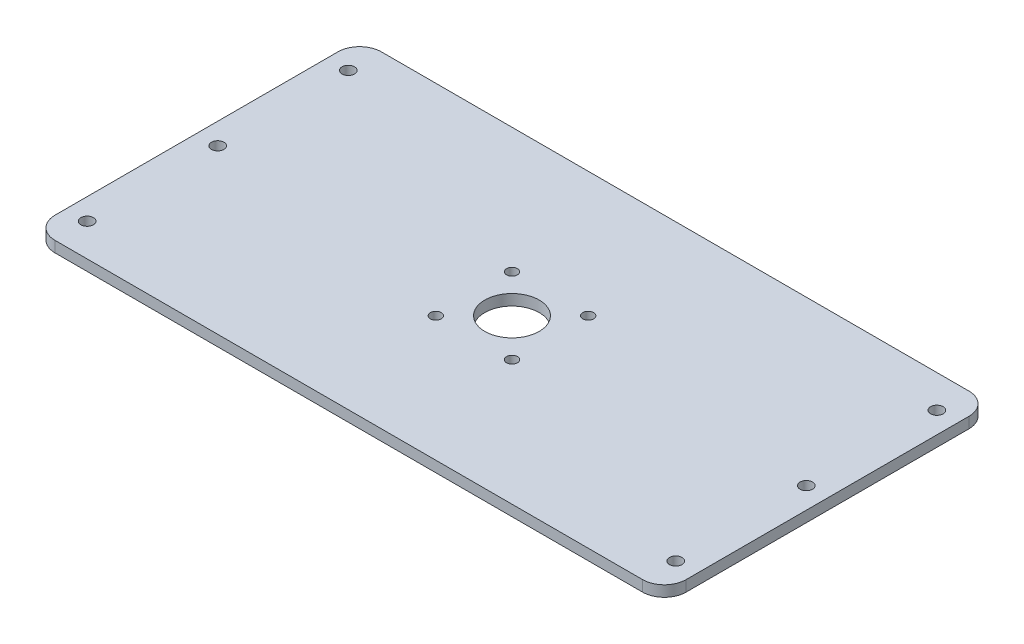
ISO-10303-21;
HEADER;
FILE_DESCRIPTION(('STEP AP214'),'2;1');
FILE_NAME('part.step','',(''),(''),'','','');
FILE_SCHEMA(('AUTOMOTIVE_DESIGN { 1 0 10303 214 1 1 1 1 }'));
ENDSEC;
DATA;
#1=APPLICATION_CONTEXT('core data for automotive mechanical design processes');
#2=APPLICATION_PROTOCOL_DEFINITION('international standard','automotive_design',2000,#1);
#3=PRODUCT_CONTEXT('',#1,'mechanical');
#4=PRODUCT('Part','Part','',(#3));
#5=PRODUCT_RELATED_PRODUCT_CATEGORY('part','',(#4));
#6=PRODUCT_DEFINITION_FORMATION('','',#4);
#7=PRODUCT_DEFINITION_CONTEXT('part definition',#1,'design');
#8=PRODUCT_DEFINITION('design','',#6,#7);
#9=PRODUCT_DEFINITION_SHAPE('','',#8);
#10=(LENGTH_UNIT() NAMED_UNIT(*) SI_UNIT(.MILLI.,.METRE.));
#11=(NAMED_UNIT(*) PLANE_ANGLE_UNIT() SI_UNIT($,.RADIAN.));
#12=(NAMED_UNIT(*) SI_UNIT($,.STERADIAN.) SOLID_ANGLE_UNIT());
#13=UNCERTAINTY_MEASURE_WITH_UNIT(LENGTH_MEASURE(1.E-05),#10,'distance_accuracy_value','');
#14=(GEOMETRIC_REPRESENTATION_CONTEXT(3) GLOBAL_UNCERTAINTY_ASSIGNED_CONTEXT((#13)) GLOBAL_UNIT_ASSIGNED_CONTEXT((#10,
#11,#12)) REPRESENTATION_CONTEXT('',''));
#15=CARTESIAN_POINT('',(0.,0.,0.));
#16=DIRECTION('',(0.,0.,1.));
#17=DIRECTION('',(1.,0.,0.));
#18=AXIS2_PLACEMENT_3D('',#15,#16,#17);
#19=CARTESIAN_POINT('',(-145.,5.,0.));
#20=DIRECTION('',(-1.,0.,0.));
#21=DIRECTION('',(0.,0.,1.));
#22=AXIS2_PLACEMENT_3D('',#19,#20,#21);
#23=PLANE('',#22);
#24=DIRECTION('',(0.,0.,-1.));
#25=VECTOR('',#24,1.);
#26=CARTESIAN_POINT('',(-145.,5.,0.));
#27=LINE('',#26,#25);
#28=CARTESIAN_POINT('',(-145.,5.,65.));
#29=VERTEX_POINT('',#28);
#30=CARTESIAN_POINT('',(-145.,5.,-65.));
#31=VERTEX_POINT('',#30);
#32=EDGE_CURVE('E187',#29,#31,#27,.T.);
#33=ORIENTED_EDGE('',*,*,#32,.T.);
#34=DIRECTION('',(0.,-1.,0.));
#35=VECTOR('',#34,1.);
#36=CARTESIAN_POINT('',(-145.,0.,-65.));
#37=LINE('',#36,#35);
#38=CARTESIAN_POINT('',(-145.,0.,-65.));
#39=VERTEX_POINT('',#38);
#40=EDGE_CURVE('E123',#31,#39,#37,.T.);
#41=ORIENTED_EDGE('',*,*,#40,.T.);
#42=DIRECTION('',(0.,0.,-1.));
#43=VECTOR('',#42,1.);
#44=CARTESIAN_POINT('',(-145.,0.,0.));
#45=LINE('',#44,#43);
#46=CARTESIAN_POINT('',(-145.,0.,65.));
#47=VERTEX_POINT('',#46);
#48=EDGE_CURVE('E114',#47,#39,#45,.T.);
#49=ORIENTED_EDGE('',*,*,#48,.F.);
#50=DIRECTION('',(0.,-1.,0.));
#51=VECTOR('',#50,1.);
#52=CARTESIAN_POINT('',(-145.,5.,65.));
#53=LINE('',#52,#51);
#54=EDGE_CURVE('E128',#47,#29,#53,.F.);
#55=ORIENTED_EDGE('',*,*,#54,.T.);
#56=EDGE_LOOP('',(#33,#41,#49,#55));
#57=FACE_BOUND('',#56,.T.);
#58=ADVANCED_FACE('F43',(#57),#23,.T.);
#59=CARTESIAN_POINT('',(0.,5.,75.));
#60=DIRECTION('',(0.,0.,1.));
#61=DIRECTION('',(1.,0.,0.));
#62=AXIS2_PLACEMENT_3D('',#59,#60,#61);
#63=PLANE('',#62);
#64=DIRECTION('',(-1.,0.,0.));
#65=VECTOR('',#64,1.);
#66=CARTESIAN_POINT('',(0.,0.,75.));
#67=LINE('',#66,#65);
#68=CARTESIAN_POINT('',(135.,0.,75.));
#69=VERTEX_POINT('',#68);
#70=CARTESIAN_POINT('',(-135.,0.,75.));
#71=VERTEX_POINT('',#70);
#72=EDGE_CURVE('E116',#69,#71,#67,.T.);
#73=ORIENTED_EDGE('',*,*,#72,.F.);
#74=DIRECTION('',(0.,-1.,0.));
#75=VECTOR('',#74,1.);
#76=CARTESIAN_POINT('',(135.,5.,75.));
#77=LINE('',#76,#75);
#78=CARTESIAN_POINT('',(135.,5.,75.));
#79=VERTEX_POINT('',#78);
#80=EDGE_CURVE('E11',#69,#79,#77,.F.);
#81=ORIENTED_EDGE('',*,*,#80,.T.);
#82=DIRECTION('',(-1.,0.,0.));
#83=VECTOR('',#82,1.);
#84=CARTESIAN_POINT('',(0.,5.,75.));
#85=LINE('',#84,#83);
#86=CARTESIAN_POINT('',(-135.,5.,75.));
#87=VERTEX_POINT('',#86);
#88=EDGE_CURVE('E184',#79,#87,#85,.T.);
#89=ORIENTED_EDGE('',*,*,#88,.T.);
#90=DIRECTION('',(0.,-1.,0.));
#91=VECTOR('',#90,1.);
#92=CARTESIAN_POINT('',(-135.,5.,75.));
#93=LINE('',#92,#91);
#94=EDGE_CURVE('E52',#87,#71,#93,.T.);
#95=ORIENTED_EDGE('',*,*,#94,.T.);
#96=EDGE_LOOP('',(#73,#81,#89,#95));
#97=FACE_BOUND('',#96,.T.);
#98=ADVANCED_FACE('F182',(#97),#63,.T.);
#99=CARTESIAN_POINT('',(145.,5.,0.));
#100=DIRECTION('',(-1.,0.,0.));
#101=DIRECTION('',(0.,0.,1.));
#102=AXIS2_PLACEMENT_3D('',#99,#100,#101);
#103=PLANE('',#102);
#104=DIRECTION('',(0.,0.,-1.));
#105=VECTOR('',#104,1.);
#106=CARTESIAN_POINT('',(145.,0.,0.));
#107=LINE('',#106,#105);
#108=CARTESIAN_POINT('',(145.,0.,65.));
#109=VERTEX_POINT('',#108);
#110=CARTESIAN_POINT('',(145.,0.,-65.));
#111=VERTEX_POINT('',#110);
#112=EDGE_CURVE('E240',#109,#111,#107,.T.);
#113=ORIENTED_EDGE('',*,*,#112,.T.);
#114=DIRECTION('',(0.,-1.,0.));
#115=VECTOR('',#114,1.);
#116=CARTESIAN_POINT('',(145.,5.,-65.));
#117=LINE('',#116,#115);
#118=CARTESIAN_POINT('',(145.,5.,-65.));
#119=VERTEX_POINT('',#118);
#120=EDGE_CURVE('E59',#111,#119,#117,.F.);
#121=ORIENTED_EDGE('',*,*,#120,.T.);
#122=DIRECTION('',(0.,0.,-1.));
#123=VECTOR('',#122,1.);
#124=CARTESIAN_POINT('',(145.,5.,0.));
#125=LINE('',#124,#123);
#126=CARTESIAN_POINT('',(145.,5.,65.));
#127=VERTEX_POINT('',#126);
#128=EDGE_CURVE('E186',#127,#119,#125,.T.);
#129=ORIENTED_EDGE('',*,*,#128,.F.);
#130=DIRECTION('',(0.,-1.,0.));
#131=VECTOR('',#130,1.);
#132=CARTESIAN_POINT('',(145.,0.,65.));
#133=LINE('',#132,#131);
#134=EDGE_CURVE('E174',#127,#109,#133,.T.);
#135=ORIENTED_EDGE('',*,*,#134,.T.);
#136=EDGE_LOOP('',(#113,#121,#129,#135));
#137=FACE_BOUND('',#136,.T.);
#138=ADVANCED_FACE('F322',(#137),#103,.F.);
#139=CARTESIAN_POINT('',(0.,5.,-75.));
#140=DIRECTION('',(0.,0.,1.));
#141=DIRECTION('',(1.,0.,0.));
#142=AXIS2_PLACEMENT_3D('',#139,#140,#141);
#143=PLANE('',#142);
#144=DIRECTION('',(-1.,0.,0.));
#145=VECTOR('',#144,1.);
#146=CARTESIAN_POINT('',(0.,0.,-75.));
#147=LINE('',#146,#145);
#148=CARTESIAN_POINT('',(135.,0.,-75.));
#149=VERTEX_POINT('',#148);
#150=CARTESIAN_POINT('',(-135.,0.,-75.));
#151=VERTEX_POINT('',#150);
#152=EDGE_CURVE('E242',#149,#151,#147,.T.);
#153=ORIENTED_EDGE('',*,*,#152,.T.);
#154=DIRECTION('',(0.,-1.,0.));
#155=VECTOR('',#154,1.);
#156=CARTESIAN_POINT('',(-135.,5.,-75.));
#157=LINE('',#156,#155);
#158=CARTESIAN_POINT('',(-135.,5.,-75.));
#159=VERTEX_POINT('',#158);
#160=EDGE_CURVE('E161',#151,#159,#157,.F.);
#161=ORIENTED_EDGE('',*,*,#160,.T.);
#162=DIRECTION('',(-1.,0.,0.));
#163=VECTOR('',#162,1.);
#164=CARTESIAN_POINT('',(0.,5.,-75.));
#165=LINE('',#164,#163);
#166=CARTESIAN_POINT('',(135.,5.,-75.));
#167=VERTEX_POINT('',#166);
#168=EDGE_CURVE('E143',#167,#159,#165,.T.);
#169=ORIENTED_EDGE('',*,*,#168,.F.);
#170=DIRECTION('',(0.,-1.,0.));
#171=VECTOR('',#170,1.);
#172=CARTESIAN_POINT('',(135.,5.,-75.));
#173=LINE('',#172,#171);
#174=EDGE_CURVE('E157',#167,#149,#173,.T.);
#175=ORIENTED_EDGE('',*,*,#174,.T.);
#176=EDGE_LOOP('',(#153,#161,#169,#175));
#177=FACE_BOUND('',#176,.T.);
#178=ADVANCED_FACE('F329',(#177),#143,.F.);
#179=CARTESIAN_POINT('',(135.225,5.,0.));
#180=DIRECTION('',(0.,-1.,0.));
#181=DIRECTION('',(0.,0.,-1.));
#182=AXIS2_PLACEMENT_3D('',#179,#180,#181);
#183=CYLINDRICAL_SURFACE('',#182,2.87499999999999);
#184=CARTESIAN_POINT('',(135.225,5.,0.));
#185=DIRECTION('',(0.,1.,0.));
#186=DIRECTION('',(0.,0.,1.));
#187=AXIS2_PLACEMENT_3D('',#184,#185,#186);
#188=CIRCLE('',#187,2.87499999999999);
#189=CARTESIAN_POINT('',(135.225,5.,2.875));
#190=VERTEX_POINT('',#189);
#191=EDGE_CURVE('E192',#190,#190,#188,.T.);
#192=ORIENTED_EDGE('',*,*,#191,.T.);
#193=EDGE_LOOP('',(#192));
#194=FACE_BOUND('',#193,.T.);
#195=CARTESIAN_POINT('',(135.225,0.,0.));
#196=DIRECTION('',(0.,1.,0.));
#197=DIRECTION('',(0.,0.,1.));
#198=AXIS2_PLACEMENT_3D('',#195,#196,#197);
#199=CIRCLE('',#198,2.87499999999999);
#200=CARTESIAN_POINT('',(135.225,0.,2.875));
#201=VERTEX_POINT('',#200);
#202=EDGE_CURVE('E132',#201,#201,#199,.T.);
#203=ORIENTED_EDGE('',*,*,#202,.F.);
#204=EDGE_LOOP('',(#203));
#205=FACE_BOUND('',#204,.T.);
#206=ADVANCED_FACE('F294',(#194,#205),#183,.F.);
#207=CARTESIAN_POINT('',(135.225,5.,-60.));
#208=DIRECTION('',(0.,-1.,0.));
#209=DIRECTION('',(0.,0.,-1.));
#210=AXIS2_PLACEMENT_3D('',#207,#208,#209);
#211=CYLINDRICAL_SURFACE('',#210,2.87499999999999);
#212=CARTESIAN_POINT('',(135.225,5.,-60.));
#213=DIRECTION('',(0.,1.,0.));
#214=DIRECTION('',(0.,0.,1.));
#215=AXIS2_PLACEMENT_3D('',#212,#213,#214);
#216=CIRCLE('',#215,2.87499999999999);
#217=CARTESIAN_POINT('',(135.225,5.,-57.125));
#218=VERTEX_POINT('',#217);
#219=EDGE_CURVE('E287',#218,#218,#216,.T.);
#220=ORIENTED_EDGE('',*,*,#219,.T.);
#221=EDGE_LOOP('',(#220));
#222=FACE_BOUND('',#221,.T.);
#223=CARTESIAN_POINT('',(135.225,0.,-60.));
#224=DIRECTION('',(0.,1.,0.));
#225=DIRECTION('',(0.,0.,1.));
#226=AXIS2_PLACEMENT_3D('',#223,#224,#225);
#227=CIRCLE('',#226,2.87499999999999);
#228=CARTESIAN_POINT('',(135.225,0.,-57.125));
#229=VERTEX_POINT('',#228);
#230=EDGE_CURVE('E231',#229,#229,#227,.T.);
#231=ORIENTED_EDGE('',*,*,#230,.F.);
#232=EDGE_LOOP('',(#231));
#233=FACE_BOUND('',#232,.T.);
#234=ADVANCED_FACE('F328',(#222,#233),#211,.F.);
#235=CARTESIAN_POINT('',(-135.225,5.,-60.));
#236=DIRECTION('',(0.,-1.,0.));
#237=DIRECTION('',(0.,0.,-1.));
#238=AXIS2_PLACEMENT_3D('',#235,#236,#237);
#239=CYLINDRICAL_SURFACE('',#238,2.87499999999999);
#240=CARTESIAN_POINT('',(-135.225,5.,-60.));
#241=DIRECTION('',(0.,1.,0.));
#242=DIRECTION('',(0.,0.,1.));
#243=AXIS2_PLACEMENT_3D('',#240,#241,#242);
#244=CIRCLE('',#243,2.87499999999999);
#245=CARTESIAN_POINT('',(-135.225,5.,-57.125));
#246=VERTEX_POINT('',#245);
#247=EDGE_CURVE('E283',#246,#246,#244,.T.);
#248=ORIENTED_EDGE('',*,*,#247,.T.);
#249=EDGE_LOOP('',(#248));
#250=FACE_BOUND('',#249,.T.);
#251=CARTESIAN_POINT('',(-135.225,0.,-60.));
#252=DIRECTION('',(0.,1.,0.));
#253=DIRECTION('',(0.,0.,1.));
#254=AXIS2_PLACEMENT_3D('',#251,#252,#253);
#255=CIRCLE('',#254,2.87499999999999);
#256=CARTESIAN_POINT('',(-135.225,0.,-57.125));
#257=VERTEX_POINT('',#256);
#258=EDGE_CURVE('E227',#257,#257,#255,.T.);
#259=ORIENTED_EDGE('',*,*,#258,.F.);
#260=EDGE_LOOP('',(#259));
#261=FACE_BOUND('',#260,.T.);
#262=ADVANCED_FACE('F332',(#250,#261),#239,.F.);
#263=CARTESIAN_POINT('',(-135.225,5.,60.));
#264=DIRECTION('',(0.,-1.,0.));
#265=DIRECTION('',(0.,0.,-1.));
#266=AXIS2_PLACEMENT_3D('',#263,#264,#265);
#267=CYLINDRICAL_SURFACE('',#266,2.87499999999999);
#268=CARTESIAN_POINT('',(-135.225,5.,60.));
#269=DIRECTION('',(0.,1.,0.));
#270=DIRECTION('',(0.,0.,1.));
#271=AXIS2_PLACEMENT_3D('',#268,#269,#270);
#272=CIRCLE('',#271,2.87499999999999);
#273=CARTESIAN_POINT('',(-135.225,5.,62.875));
#274=VERTEX_POINT('',#273);
#275=EDGE_CURVE('E279',#274,#274,#272,.F.);
#276=ORIENTED_EDGE('',*,*,#275,.F.);
#277=EDGE_LOOP('',(#276));
#278=FACE_BOUND('',#277,.T.);
#279=CARTESIAN_POINT('',(-135.225,0.,60.));
#280=DIRECTION('',(0.,1.,0.));
#281=DIRECTION('',(0.,0.,1.));
#282=AXIS2_PLACEMENT_3D('',#279,#280,#281);
#283=CIRCLE('',#282,2.87499999999999);
#284=CARTESIAN_POINT('',(-135.225,0.,62.875));
#285=VERTEX_POINT('',#284);
#286=EDGE_CURVE('E223',#285,#285,#283,.F.);
#287=ORIENTED_EDGE('',*,*,#286,.T.);
#288=EDGE_LOOP('',(#287));
#289=FACE_BOUND('',#288,.T.);
#290=ADVANCED_FACE('F336',(#278,#289),#267,.F.);
#291=CARTESIAN_POINT('',(0.,5.,0.));
#292=DIRECTION('',(0.,-1.,0.));
#293=DIRECTION('',(0.,0.,-1.));
#294=AXIS2_PLACEMENT_3D('',#291,#292,#293);
#295=CYLINDRICAL_SURFACE('',#294,12.5);
#296=CARTESIAN_POINT('',(0.,5.,0.));
#297=DIRECTION('',(0.,1.,0.));
#298=DIRECTION('',(0.,0.,1.));
#299=AXIS2_PLACEMENT_3D('',#296,#297,#298);
#300=CIRCLE('',#299,12.5);
#301=CARTESIAN_POINT('',(0.,5.,12.5));
#302=VERTEX_POINT('',#301);
#303=EDGE_CURVE('E275',#302,#302,#300,.T.);
#304=ORIENTED_EDGE('',*,*,#303,.T.);
#305=EDGE_LOOP('',(#304));
#306=FACE_BOUND('',#305,.T.);
#307=CARTESIAN_POINT('',(0.,0.,0.));
#308=DIRECTION('',(0.,1.,0.));
#309=DIRECTION('',(0.,0.,1.));
#310=AXIS2_PLACEMENT_3D('',#307,#308,#309);
#311=CIRCLE('',#310,12.5);
#312=CARTESIAN_POINT('',(0.,0.,12.5));
#313=VERTEX_POINT('',#312);
#314=EDGE_CURVE('E219',#313,#313,#311,.T.);
#315=ORIENTED_EDGE('',*,*,#314,.F.);
#316=EDGE_LOOP('',(#315));
#317=FACE_BOUND('',#316,.T.);
#318=ADVANCED_FACE('F340',(#306,#317),#295,.F.);
#319=CARTESIAN_POINT('',(-17.5,5.,-17.5));
#320=DIRECTION('',(0.,-1.,0.));
#321=DIRECTION('',(0.,0.,-1.));
#322=AXIS2_PLACEMENT_3D('',#319,#320,#321);
#323=CYLINDRICAL_SURFACE('',#322,2.5);
#324=CARTESIAN_POINT('',(-17.5,5.,-17.5));
#325=DIRECTION('',(0.,1.,0.));
#326=DIRECTION('',(0.,0.,1.));
#327=AXIS2_PLACEMENT_3D('',#324,#325,#326);
#328=CIRCLE('',#327,2.5);
#329=CARTESIAN_POINT('',(-17.5,5.,-15.));
#330=VERTEX_POINT('',#329);
#331=EDGE_CURVE('E271',#330,#330,#328,.T.);
#332=ORIENTED_EDGE('',*,*,#331,.T.);
#333=EDGE_LOOP('',(#332));
#334=FACE_BOUND('',#333,.T.);
#335=CARTESIAN_POINT('',(-17.5,0.,-17.5));
#336=DIRECTION('',(0.,1.,0.));
#337=DIRECTION('',(0.,0.,1.));
#338=AXIS2_PLACEMENT_3D('',#335,#336,#337);
#339=CIRCLE('',#338,2.5);
#340=CARTESIAN_POINT('',(-17.5,0.,-15.));
#341=VERTEX_POINT('',#340);
#342=EDGE_CURVE('E215',#341,#341,#339,.T.);
#343=ORIENTED_EDGE('',*,*,#342,.F.);
#344=EDGE_LOOP('',(#343));
#345=FACE_BOUND('',#344,.T.);
#346=ADVANCED_FACE('F344',(#334,#345),#323,.F.);
#347=CARTESIAN_POINT('',(17.5,5.,-17.5));
#348=DIRECTION('',(0.,-1.,0.));
#349=DIRECTION('',(0.,0.,-1.));
#350=AXIS2_PLACEMENT_3D('',#347,#348,#349);
#351=CYLINDRICAL_SURFACE('',#350,2.5);
#352=CARTESIAN_POINT('',(17.5,5.,-17.5));
#353=DIRECTION('',(0.,1.,0.));
#354=DIRECTION('',(0.,0.,1.));
#355=AXIS2_PLACEMENT_3D('',#352,#353,#354);
#356=CIRCLE('',#355,2.5);
#357=CARTESIAN_POINT('',(17.5,5.,-15.));
#358=VERTEX_POINT('',#357);
#359=EDGE_CURVE('E267',#358,#358,#356,.T.);
#360=ORIENTED_EDGE('',*,*,#359,.T.);
#361=EDGE_LOOP('',(#360));
#362=FACE_BOUND('',#361,.T.);
#363=CARTESIAN_POINT('',(17.5,0.,-17.5));
#364=DIRECTION('',(0.,1.,0.));
#365=DIRECTION('',(0.,0.,1.));
#366=AXIS2_PLACEMENT_3D('',#363,#364,#365);
#367=CIRCLE('',#366,2.5);
#368=CARTESIAN_POINT('',(17.5,0.,-15.));
#369=VERTEX_POINT('',#368);
#370=EDGE_CURVE('E211',#369,#369,#367,.T.);
#371=ORIENTED_EDGE('',*,*,#370,.F.);
#372=EDGE_LOOP('',(#371));
#373=FACE_BOUND('',#372,.T.);
#374=ADVANCED_FACE('F348',(#362,#373),#351,.F.);
#375=CARTESIAN_POINT('',(17.5000000000004,5.,17.5));
#376=DIRECTION('',(0.,-1.,0.));
#377=DIRECTION('',(0.,0.,-1.));
#378=AXIS2_PLACEMENT_3D('',#375,#376,#377);
#379=CYLINDRICAL_SURFACE('',#378,2.5);
#380=CARTESIAN_POINT('',(17.5000000000004,5.,17.5));
#381=DIRECTION('',(0.,1.,0.));
#382=DIRECTION('',(0.,0.,1.));
#383=AXIS2_PLACEMENT_3D('',#380,#381,#382);
#384=CIRCLE('',#383,2.5);
#385=CARTESIAN_POINT('',(17.5000000000004,5.,20.));
#386=VERTEX_POINT('',#385);
#387=EDGE_CURVE('E261',#386,#386,#384,.T.);
#388=ORIENTED_EDGE('',*,*,#387,.T.);
#389=EDGE_LOOP('',(#388));
#390=FACE_BOUND('',#389,.T.);
#391=CARTESIAN_POINT('',(17.5000000000004,0.,17.5));
#392=DIRECTION('',(0.,1.,0.));
#393=DIRECTION('',(0.,0.,1.));
#394=AXIS2_PLACEMENT_3D('',#391,#392,#393);
#395=CIRCLE('',#394,2.5);
#396=CARTESIAN_POINT('',(17.5000000000004,0.,20.));
#397=VERTEX_POINT('',#396);
#398=EDGE_CURVE('E207',#397,#397,#395,.T.);
#399=ORIENTED_EDGE('',*,*,#398,.F.);
#400=EDGE_LOOP('',(#399));
#401=FACE_BOUND('',#400,.T.);
#402=ADVANCED_FACE('F352',(#390,#401),#379,.F.);
#403=CARTESIAN_POINT('',(-17.4999999999996,5.,17.5));
#404=DIRECTION('',(0.,-1.,0.));
#405=DIRECTION('',(0.,0.,-1.));
#406=AXIS2_PLACEMENT_3D('',#403,#404,#405);
#407=CYLINDRICAL_SURFACE('',#406,2.5);
#408=CARTESIAN_POINT('',(-17.4999999999996,5.,17.5));
#409=DIRECTION('',(0.,1.,0.));
#410=DIRECTION('',(0.,0.,1.));
#411=AXIS2_PLACEMENT_3D('',#408,#409,#410);
#412=CIRCLE('',#411,2.5);
#413=CARTESIAN_POINT('',(-17.4999999999996,5.,20.));
#414=VERTEX_POINT('',#413);
#415=EDGE_CURVE('E255',#414,#414,#412,.T.);
#416=ORIENTED_EDGE('',*,*,#415,.T.);
#417=EDGE_LOOP('',(#416));
#418=FACE_BOUND('',#417,.T.);
#419=CARTESIAN_POINT('',(-17.4999999999996,0.,17.5));
#420=DIRECTION('',(0.,1.,0.));
#421=DIRECTION('',(0.,0.,1.));
#422=AXIS2_PLACEMENT_3D('',#419,#420,#421);
#423=CIRCLE('',#422,2.5);
#424=CARTESIAN_POINT('',(-17.4999999999996,0.,20.));
#425=VERTEX_POINT('',#424);
#426=EDGE_CURVE('E203',#425,#425,#423,.T.);
#427=ORIENTED_EDGE('',*,*,#426,.F.);
#428=EDGE_LOOP('',(#427));
#429=FACE_BOUND('',#428,.T.);
#430=ADVANCED_FACE('F313',(#418,#429),#407,.F.);
#431=CARTESIAN_POINT('',(-135.225,5.,0.));
#432=DIRECTION('',(0.,-1.,0.));
#433=DIRECTION('',(0.,0.,-1.));
#434=AXIS2_PLACEMENT_3D('',#431,#432,#433);
#435=CYLINDRICAL_SURFACE('',#434,2.87499999999999);
#436=CARTESIAN_POINT('',(-135.225,5.,0.));
#437=DIRECTION('',(0.,1.,0.));
#438=DIRECTION('',(0.,0.,1.));
#439=AXIS2_PLACEMENT_3D('',#436,#437,#438);
#440=CIRCLE('',#439,2.87499999999999);
#441=CARTESIAN_POINT('',(-135.225,5.,2.875));
#442=VERTEX_POINT('',#441);
#443=EDGE_CURVE('E250',#442,#442,#440,.T.);
#444=ORIENTED_EDGE('',*,*,#443,.T.);
#445=EDGE_LOOP('',(#444));
#446=FACE_BOUND('',#445,.T.);
#447=CARTESIAN_POINT('',(-135.225,0.,0.));
#448=DIRECTION('',(0.,1.,0.));
#449=DIRECTION('',(0.,0.,1.));
#450=AXIS2_PLACEMENT_3D('',#447,#448,#449);
#451=CIRCLE('',#450,2.87499999999999);
#452=CARTESIAN_POINT('',(-135.225,0.,2.875));
#453=VERTEX_POINT('',#452);
#454=EDGE_CURVE('E199',#453,#453,#451,.T.);
#455=ORIENTED_EDGE('',*,*,#454,.F.);
#456=EDGE_LOOP('',(#455));
#457=FACE_BOUND('',#456,.T.);
#458=ADVANCED_FACE('F308',(#446,#457),#435,.F.);
#459=CARTESIAN_POINT('',(135.225,5.,60.));
#460=DIRECTION('',(0.,-1.,0.));
#461=DIRECTION('',(0.,0.,-1.));
#462=AXIS2_PLACEMENT_3D('',#459,#460,#461);
#463=CYLINDRICAL_SURFACE('',#462,2.87499999999999);
#464=CARTESIAN_POINT('',(135.225,5.,60.));
#465=DIRECTION('',(0.,1.,0.));
#466=DIRECTION('',(0.,0.,1.));
#467=AXIS2_PLACEMENT_3D('',#464,#465,#466);
#468=CIRCLE('',#467,2.87499999999999);
#469=CARTESIAN_POINT('',(135.225,5.,62.8749999999999));
#470=VERTEX_POINT('',#469);
#471=EDGE_CURVE('E137',#470,#470,#468,.F.);
#472=ORIENTED_EDGE('',*,*,#471,.F.);
#473=EDGE_LOOP('',(#472));
#474=FACE_BOUND('',#473,.T.);
#475=CARTESIAN_POINT('',(135.225,0.,60.));
#476=DIRECTION('',(0.,1.,0.));
#477=DIRECTION('',(0.,0.,1.));
#478=AXIS2_PLACEMENT_3D('',#475,#476,#477);
#479=CIRCLE('',#478,2.87499999999999);
#480=CARTESIAN_POINT('',(135.225,0.,62.8749999999999));
#481=VERTEX_POINT('',#480);
#482=EDGE_CURVE('E146',#481,#481,#479,.F.);
#483=ORIENTED_EDGE('',*,*,#482,.T.);
#484=EDGE_LOOP('',(#483));
#485=FACE_BOUND('',#484,.T.);
#486=ADVANCED_FACE('F299',(#474,#485),#463,.F.);
#487=CARTESIAN_POINT('',(0.,5.,0.));
#488=DIRECTION('',(0.,1.,0.));
#489=DIRECTION('',(0.,0.,1.));
#490=AXIS2_PLACEMENT_3D('',#487,#488,#489);
#491=PLANE('',#490);
#492=ORIENTED_EDGE('',*,*,#443,.F.);
#493=EDGE_LOOP('',(#492));
#494=FACE_BOUND('',#493,.T.);
#495=ORIENTED_EDGE('',*,*,#415,.F.);
#496=EDGE_LOOP('',(#495));
#497=FACE_BOUND('',#496,.T.);
#498=ORIENTED_EDGE('',*,*,#387,.F.);
#499=EDGE_LOOP('',(#498));
#500=FACE_BOUND('',#499,.T.);
#501=ORIENTED_EDGE('',*,*,#359,.F.);
#502=EDGE_LOOP('',(#501));
#503=FACE_BOUND('',#502,.T.);
#504=ORIENTED_EDGE('',*,*,#331,.F.);
#505=EDGE_LOOP('',(#504));
#506=FACE_BOUND('',#505,.T.);
#507=ORIENTED_EDGE('',*,*,#303,.F.);
#508=EDGE_LOOP('',(#507));
#509=FACE_BOUND('',#508,.T.);
#510=ORIENTED_EDGE('',*,*,#275,.T.);
#511=EDGE_LOOP('',(#510));
#512=FACE_BOUND('',#511,.T.);
#513=ORIENTED_EDGE('',*,*,#247,.F.);
#514=EDGE_LOOP('',(#513));
#515=FACE_BOUND('',#514,.T.);
#516=ORIENTED_EDGE('',*,*,#219,.F.);
#517=EDGE_LOOP('',(#516));
#518=FACE_BOUND('',#517,.T.);
#519=ORIENTED_EDGE('',*,*,#191,.F.);
#520=EDGE_LOOP('',(#519));
#521=FACE_BOUND('',#520,.T.);
#522=ORIENTED_EDGE('',*,*,#168,.T.);
#523=CARTESIAN_POINT('',(-135.,5.,-65.));
#524=DIRECTION('',(0.,1.,0.));
#525=DIRECTION('',(0.,0.,1.));
#526=AXIS2_PLACEMENT_3D('',#523,#524,#525);
#527=CIRCLE('',#526,10.);
#528=EDGE_CURVE('E171',#159,#31,#527,.T.);
#529=ORIENTED_EDGE('',*,*,#528,.T.);
#530=ORIENTED_EDGE('',*,*,#32,.F.);
#531=CARTESIAN_POINT('',(-135.,5.,65.));
#532=DIRECTION('',(0.,1.,0.));
#533=DIRECTION('',(0.,0.,1.));
#534=AXIS2_PLACEMENT_3D('',#531,#532,#533);
#535=CIRCLE('',#534,10.);
#536=EDGE_CURVE('E135',#29,#87,#535,.T.);
#537=ORIENTED_EDGE('',*,*,#536,.T.);
#538=ORIENTED_EDGE('',*,*,#88,.F.);
#539=CARTESIAN_POINT('',(135.,5.,65.));
#540=DIRECTION('',(0.,1.,0.));
#541=DIRECTION('',(0.,0.,1.));
#542=AXIS2_PLACEMENT_3D('',#539,#540,#541);
#543=CIRCLE('',#542,10.);
#544=EDGE_CURVE('E66',#79,#127,#543,.T.);
#545=ORIENTED_EDGE('',*,*,#544,.T.);
#546=ORIENTED_EDGE('',*,*,#128,.T.);
#547=CARTESIAN_POINT('',(135.,5.,-65.));
#548=DIRECTION('',(0.,1.,0.));
#549=DIRECTION('',(0.,0.,1.));
#550=AXIS2_PLACEMENT_3D('',#547,#548,#549);
#551=CIRCLE('',#550,10.);
#552=EDGE_CURVE('E168',#119,#167,#551,.T.);
#553=ORIENTED_EDGE('',*,*,#552,.T.);
#554=EDGE_LOOP('',(#522,#529,#530,#537,#538,#545,#546,#553));
#555=FACE_BOUND('',#554,.T.);
#556=ORIENTED_EDGE('',*,*,#471,.T.);
#557=EDGE_LOOP('',(#556));
#558=FACE_BOUND('',#557,.T.);
#559=ADVANCED_FACE('F297',(#494,#497,#500,#503,#506,#509,#512,#515,#518,#521,#555,#558),#491,.T.);
#560=CARTESIAN_POINT('',(0.,0.,0.));
#561=DIRECTION('',(0.,1.,0.));
#562=DIRECTION('',(0.,0.,1.));
#563=AXIS2_PLACEMENT_3D('',#560,#561,#562);
#564=PLANE('',#563);
#565=ORIENTED_EDGE('',*,*,#454,.T.);
#566=EDGE_LOOP('',(#565));
#567=FACE_BOUND('',#566,.T.);
#568=ORIENTED_EDGE('',*,*,#426,.T.);
#569=EDGE_LOOP('',(#568));
#570=FACE_BOUND('',#569,.T.);
#571=ORIENTED_EDGE('',*,*,#398,.T.);
#572=EDGE_LOOP('',(#571));
#573=FACE_BOUND('',#572,.T.);
#574=ORIENTED_EDGE('',*,*,#370,.T.);
#575=EDGE_LOOP('',(#574));
#576=FACE_BOUND('',#575,.T.);
#577=ORIENTED_EDGE('',*,*,#342,.T.);
#578=EDGE_LOOP('',(#577));
#579=FACE_BOUND('',#578,.T.);
#580=ORIENTED_EDGE('',*,*,#314,.T.);
#581=EDGE_LOOP('',(#580));
#582=FACE_BOUND('',#581,.T.);
#583=ORIENTED_EDGE('',*,*,#286,.F.);
#584=EDGE_LOOP('',(#583));
#585=FACE_BOUND('',#584,.T.);
#586=ORIENTED_EDGE('',*,*,#258,.T.);
#587=EDGE_LOOP('',(#586));
#588=FACE_BOUND('',#587,.T.);
#589=ORIENTED_EDGE('',*,*,#230,.T.);
#590=EDGE_LOOP('',(#589));
#591=FACE_BOUND('',#590,.T.);
#592=ORIENTED_EDGE('',*,*,#202,.T.);
#593=EDGE_LOOP('',(#592));
#594=FACE_BOUND('',#593,.T.);
#595=ORIENTED_EDGE('',*,*,#48,.T.);
#596=CARTESIAN_POINT('',(-135.,0.,-65.));
#597=DIRECTION('',(0.,1.,0.));
#598=DIRECTION('',(0.,0.,1.));
#599=AXIS2_PLACEMENT_3D('',#596,#597,#598);
#600=CIRCLE('',#599,10.);
#601=EDGE_CURVE('E154',#39,#151,#600,.F.);
#602=ORIENTED_EDGE('',*,*,#601,.T.);
#603=ORIENTED_EDGE('',*,*,#152,.F.);
#604=CARTESIAN_POINT('',(135.,0.,-65.));
#605=DIRECTION('',(0.,1.,0.));
#606=DIRECTION('',(0.,0.,1.));
#607=AXIS2_PLACEMENT_3D('',#604,#605,#606);
#608=CIRCLE('',#607,10.);
#609=EDGE_CURVE('E151',#149,#111,#608,.F.);
#610=ORIENTED_EDGE('',*,*,#609,.T.);
#611=ORIENTED_EDGE('',*,*,#112,.F.);
#612=CARTESIAN_POINT('',(135.,0.,65.));
#613=DIRECTION('',(0.,1.,0.));
#614=DIRECTION('',(0.,0.,1.));
#615=AXIS2_PLACEMENT_3D('',#612,#613,#614);
#616=CIRCLE('',#615,10.);
#617=EDGE_CURVE('E122',#109,#69,#616,.F.);
#618=ORIENTED_EDGE('',*,*,#617,.T.);
#619=ORIENTED_EDGE('',*,*,#72,.T.);
#620=CARTESIAN_POINT('',(-135.,0.,65.));
#621=DIRECTION('',(0.,1.,0.));
#622=DIRECTION('',(0.,0.,1.));
#623=AXIS2_PLACEMENT_3D('',#620,#621,#622);
#624=CIRCLE('',#623,10.);
#625=EDGE_CURVE('E110',#71,#47,#624,.F.);
#626=ORIENTED_EDGE('',*,*,#625,.T.);
#627=EDGE_LOOP('',(#595,#602,#603,#610,#611,#618,#619,#626));
#628=FACE_BOUND('',#627,.T.);
#629=ORIENTED_EDGE('',*,*,#482,.F.);
#630=EDGE_LOOP('',(#629));
#631=FACE_BOUND('',#630,.T.);
#632=ADVANCED_FACE('F112',(#567,#570,#573,#576,#579,#582,#585,#588,#591,#594,#628,#631),#564,.F.);
#633=CARTESIAN_POINT('',(-135.,5.,-65.));
#634=DIRECTION('',(0.,1.,0.));
#635=DIRECTION('',(0.,0.,1.));
#636=AXIS2_PLACEMENT_3D('',#633,#634,#635);
#637=CYLINDRICAL_SURFACE('',#636,10.);
#638=ORIENTED_EDGE('',*,*,#528,.F.);
#639=ORIENTED_EDGE('',*,*,#160,.F.);
#640=ORIENTED_EDGE('',*,*,#601,.F.);
#641=ORIENTED_EDGE('',*,*,#40,.F.);
#642=EDGE_LOOP('',(#638,#639,#640,#641));
#643=FACE_BOUND('',#642,.T.);
#644=ADVANCED_FACE('F360',(#643),#637,.T.);
#645=CARTESIAN_POINT('',(135.,5.,-65.));
#646=DIRECTION('',(0.,-1.,0.));
#647=DIRECTION('',(0.,0.,-1.));
#648=AXIS2_PLACEMENT_3D('',#645,#646,#647);
#649=CYLINDRICAL_SURFACE('',#648,10.);
#650=ORIENTED_EDGE('',*,*,#552,.F.);
#651=ORIENTED_EDGE('',*,*,#120,.F.);
#652=ORIENTED_EDGE('',*,*,#609,.F.);
#653=ORIENTED_EDGE('',*,*,#174,.F.);
#654=EDGE_LOOP('',(#650,#651,#652,#653));
#655=FACE_BOUND('',#654,.T.);
#656=ADVANCED_FACE('F363',(#655),#649,.T.);
#657=CARTESIAN_POINT('',(135.,5.,65.));
#658=DIRECTION('',(0.,1.,0.));
#659=DIRECTION('',(0.,0.,1.));
#660=AXIS2_PLACEMENT_3D('',#657,#658,#659);
#661=CYLINDRICAL_SURFACE('',#660,10.);
#662=ORIENTED_EDGE('',*,*,#544,.F.);
#663=ORIENTED_EDGE('',*,*,#80,.F.);
#664=ORIENTED_EDGE('',*,*,#617,.F.);
#665=ORIENTED_EDGE('',*,*,#134,.F.);
#666=EDGE_LOOP('',(#662,#663,#664,#665));
#667=FACE_BOUND('',#666,.T.);
#668=ADVANCED_FACE('F366',(#667),#661,.T.);
#669=CARTESIAN_POINT('',(-135.,5.,65.));
#670=DIRECTION('',(0.,-1.,0.));
#671=DIRECTION('',(0.,0.,-1.));
#672=AXIS2_PLACEMENT_3D('',#669,#670,#671);
#673=CYLINDRICAL_SURFACE('',#672,10.);
#674=ORIENTED_EDGE('',*,*,#536,.F.);
#675=ORIENTED_EDGE('',*,*,#54,.F.);
#676=ORIENTED_EDGE('',*,*,#625,.F.);
#677=ORIENTED_EDGE('',*,*,#94,.F.);
#678=EDGE_LOOP('',(#674,#675,#676,#677));
#679=FACE_BOUND('',#678,.T.);
#680=ADVANCED_FACE('F45',(#679),#673,.T.);
#681=CLOSED_SHELL('',(#58,#98,#138,#178,#206,#234,#262,#290,#318,#346,#374,#402,#430,#458,#486,
#559,#632,#644,#656,#668,#680));
#682=MANIFOLD_SOLID_BREP('B2',#681);
#683=ADVANCED_BREP_SHAPE_REPRESENTATION('',(#18,#682),#14);
#684=SHAPE_DEFINITION_REPRESENTATION(#9,#683);
ENDSEC;
END-ISO-10303-21;
